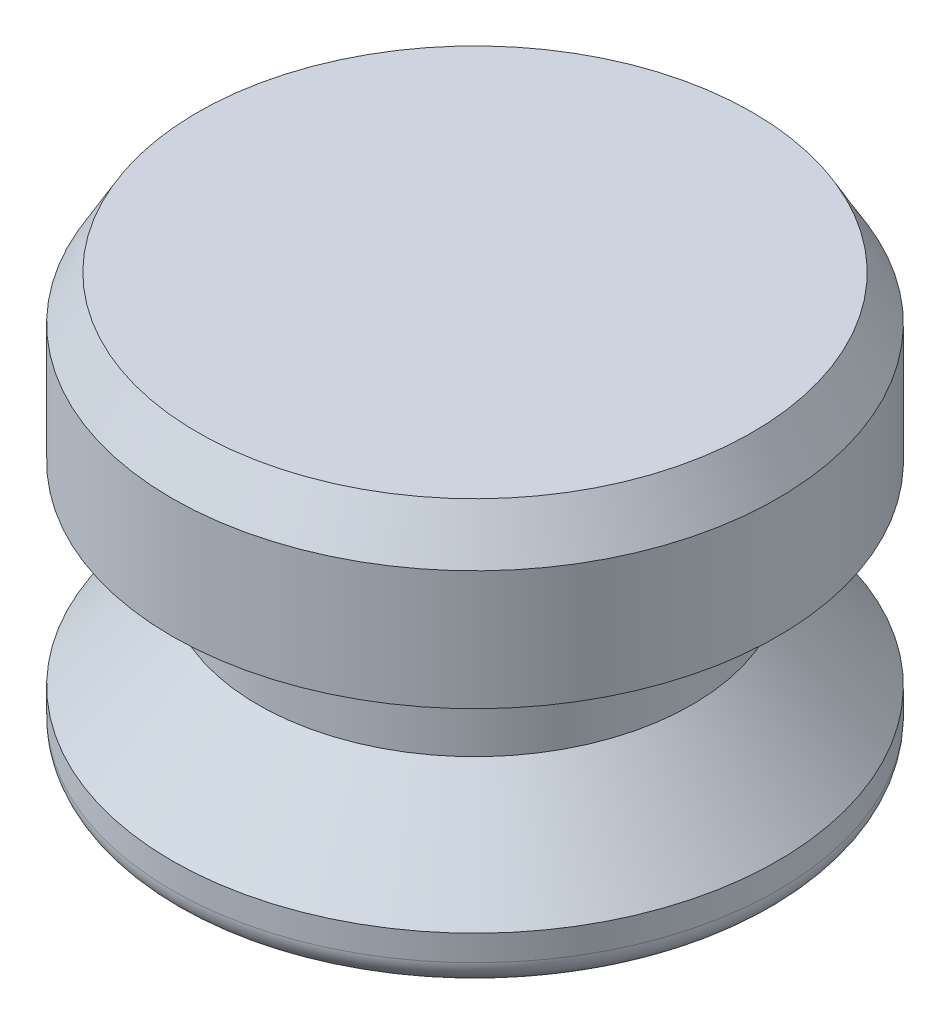
ISO-10303-21;
HEADER;
FILE_DESCRIPTION(('STEP AP214'),'2;1');
FILE_NAME('part.step','',(''),(''),'','','');
FILE_SCHEMA(('AUTOMOTIVE_DESIGN { 1 0 10303 214 1 1 1 1 }'));
ENDSEC;
DATA;
#1=APPLICATION_CONTEXT('core data for automotive mechanical design processes');
#2=APPLICATION_PROTOCOL_DEFINITION('international standard','automotive_design',2000,#1);
#3=PRODUCT_CONTEXT('',#1,'mechanical');
#4=PRODUCT('Part','Part','',(#3));
#5=PRODUCT_RELATED_PRODUCT_CATEGORY('part','',(#4));
#6=PRODUCT_DEFINITION_FORMATION('','',#4);
#7=PRODUCT_DEFINITION_CONTEXT('part definition',#1,'design');
#8=PRODUCT_DEFINITION('design','',#6,#7);
#9=PRODUCT_DEFINITION_SHAPE('','',#8);
#10=(LENGTH_UNIT() NAMED_UNIT(*) SI_UNIT(.MILLI.,.METRE.));
#11=(NAMED_UNIT(*) PLANE_ANGLE_UNIT() SI_UNIT($,.RADIAN.));
#12=(NAMED_UNIT(*) SI_UNIT($,.STERADIAN.) SOLID_ANGLE_UNIT());
#13=UNCERTAINTY_MEASURE_WITH_UNIT(LENGTH_MEASURE(1.E-05),#10,'distance_accuracy_value','');
#14=(GEOMETRIC_REPRESENTATION_CONTEXT(3) GLOBAL_UNCERTAINTY_ASSIGNED_CONTEXT((#13)) GLOBAL_UNIT_ASSIGNED_CONTEXT((#10,
#11,#12)) REPRESENTATION_CONTEXT('',''));
#15=CARTESIAN_POINT('',(0.,0.,0.));
#16=DIRECTION('',(0.,0.,1.));
#17=DIRECTION('',(1.,0.,0.));
#18=AXIS2_PLACEMENT_3D('',#15,#16,#17);
#19=CARTESIAN_POINT('',(0.,0.,0.));
#20=DIRECTION('',(0.,1.,0.));
#21=DIRECTION('',(0.,0.,1.));
#22=AXIS2_PLACEMENT_3D('',#19,#20,#21);
#23=PLANE('',#22);
#24=CARTESIAN_POINT('',(0.,0.,0.));
#25=DIRECTION('',(0.,1.,0.));
#26=DIRECTION('',(0.,0.,1.));
#27=AXIS2_PLACEMENT_3D('',#24,#25,#26);
#28=CIRCLE('',#27,8.60425);
#29=CARTESIAN_POINT('',(0.,0.,8.60425));
#30=VERTEX_POINT('',#29);
#31=EDGE_CURVE('E46',#30,#30,#28,.F.);
#32=ORIENTED_EDGE('',*,*,#31,.T.);
#33=EDGE_LOOP('',(#32));
#34=FACE_BOUND('',#33,.T.);
#35=ADVANCED_FACE('F31',(#34),#23,.F.);
#36=CARTESIAN_POINT('',(0.,0.,0.));
#37=DIRECTION('',(0.,-1.,0.));
#38=DIRECTION('',(0.,0.,-1.));
#39=AXIS2_PLACEMENT_3D('',#36,#37,#38);
#40=CYLINDRICAL_SURFACE('',#39,9.398);
#41=CARTESIAN_POINT('',(0.,0.793749999999999,0.));
#42=DIRECTION('',(0.,1.,0.));
#43=DIRECTION('',(0.,0.,1.));
#44=AXIS2_PLACEMENT_3D('',#41,#42,#43);
#45=CIRCLE('',#44,9.398);
#46=CARTESIAN_POINT('',(0.,0.793749999999999,9.398));
#47=VERTEX_POINT('',#46);
#48=EDGE_CURVE('E42',#47,#47,#45,.T.);
#49=ORIENTED_EDGE('',*,*,#48,.T.);
#50=EDGE_LOOP('',(#49));
#51=FACE_BOUND('',#50,.T.);
#52=CARTESIAN_POINT('',(0.,1.5875,0.));
#53=DIRECTION('',(0.,-1.,0.));
#54=DIRECTION('',(0.,0.,-1.));
#55=AXIS2_PLACEMENT_3D('',#52,#53,#54);
#56=CIRCLE('',#55,9.398);
#57=CARTESIAN_POINT('',(0.,1.5875,-9.398));
#58=VERTEX_POINT('',#57);
#59=EDGE_CURVE('E51',#58,#58,#56,.T.);
#60=ORIENTED_EDGE('',*,*,#59,.T.);
#61=EDGE_LOOP('',(#60));
#62=FACE_BOUND('',#61,.T.);
#63=ADVANCED_FACE('F80',(#51,#62),#40,.T.);
#64=CARTESIAN_POINT('',(0.,4.445,0.));
#65=DIRECTION('',(0.,-1.,0.));
#66=DIRECTION('',(0.,0.,-1.));
#67=AXIS2_PLACEMENT_3D('',#64,#65,#66);
#68=CONICAL_SURFACE('',#67,6.731,0.75092906239794);
#69=ORIENTED_EDGE('',*,*,#59,.F.);
#70=EDGE_LOOP('',(#69));
#71=FACE_BOUND('',#70,.T.);
#72=CARTESIAN_POINT('',(0.,4.445,0.));
#73=DIRECTION('',(0.,-1.,0.));
#74=DIRECTION('',(0.,0.,-1.));
#75=AXIS2_PLACEMENT_3D('',#72,#73,#74);
#76=CIRCLE('',#75,6.731);
#77=CARTESIAN_POINT('',(0.,4.445,-6.731));
#78=VERTEX_POINT('',#77);
#79=EDGE_CURVE('E54',#78,#78,#76,.T.);
#80=ORIENTED_EDGE('',*,*,#79,.T.);
#81=EDGE_LOOP('',(#80));
#82=FACE_BOUND('',#81,.T.);
#83=ADVANCED_FACE('F86',(#71,#82),#68,.T.);
#84=CARTESIAN_POINT('',(0.,0.,0.));
#85=DIRECTION('',(0.,-1.,0.));
#86=DIRECTION('',(0.,0.,-1.));
#87=AXIS2_PLACEMENT_3D('',#84,#85,#86);
#88=CYLINDRICAL_SURFACE('',#87,6.731);
#89=ORIENTED_EDGE('',*,*,#79,.F.);
#90=EDGE_LOOP('',(#89));
#91=FACE_BOUND('',#90,.T.);
#92=CARTESIAN_POINT('',(0.,7.62,0.));
#93=DIRECTION('',(0.,-1.,0.));
#94=DIRECTION('',(0.,0.,-1.));
#95=AXIS2_PLACEMENT_3D('',#92,#93,#94);
#96=CIRCLE('',#95,6.731);
#97=CARTESIAN_POINT('',(0.,7.62,-6.731));
#98=VERTEX_POINT('',#97);
#99=EDGE_CURVE('E57',#98,#98,#96,.T.);
#100=ORIENTED_EDGE('',*,*,#99,.T.);
#101=EDGE_LOOP('',(#100));
#102=FACE_BOUND('',#101,.T.);
#103=ADVANCED_FACE('F76',(#91,#102),#88,.T.);
#104=CARTESIAN_POINT('',(-6.731,7.62,0.));
#105=DIRECTION('',(0.,1.,0.));
#106=DIRECTION('',(0.,0.,1.));
#107=AXIS2_PLACEMENT_3D('',#104,#105,#106);
#108=PLANE('',#107);
#109=ORIENTED_EDGE('',*,*,#99,.F.);
#110=EDGE_LOOP('',(#109));
#111=FACE_BOUND('',#110,.T.);
#112=CARTESIAN_POINT('',(0.,7.62,0.));
#113=DIRECTION('',(0.,-1.,0.));
#114=DIRECTION('',(0.,0.,-1.));
#115=AXIS2_PLACEMENT_3D('',#112,#113,#114);
#116=CIRCLE('',#115,9.398);
#117=CARTESIAN_POINT('',(0.,7.62,-9.398));
#118=VERTEX_POINT('',#117);
#119=EDGE_CURVE('E60',#118,#118,#116,.T.);
#120=ORIENTED_EDGE('',*,*,#119,.T.);
#121=EDGE_LOOP('',(#120));
#122=FACE_BOUND('',#121,.T.);
#123=ADVANCED_FACE('F64',(#111,#122),#108,.F.);
#124=CARTESIAN_POINT('',(0.,0.,0.));
#125=DIRECTION('',(0.,-1.,0.));
#126=DIRECTION('',(0.,0.,-1.));
#127=AXIS2_PLACEMENT_3D('',#124,#125,#126);
#128=CYLINDRICAL_SURFACE('',#127,9.398);
#129=CARTESIAN_POINT('',(0.,11.3251846714922,0.));
#130=DIRECTION('',(0.,-1.,0.));
#131=DIRECTION('',(0.,0.,-1.));
#132=AXIS2_PLACEMENT_3D('',#129,#130,#131);
#133=CIRCLE('',#132,9.398);
#134=CARTESIAN_POINT('',(0.,11.3251846714922,-9.398));
#135=VERTEX_POINT('',#134);
#136=EDGE_CURVE('E38',#135,#135,#133,.T.);
#137=ORIENTED_EDGE('',*,*,#136,.T.);
#138=EDGE_LOOP('',(#137));
#139=FACE_BOUND('',#138,.T.);
#140=ORIENTED_EDGE('',*,*,#119,.F.);
#141=EDGE_LOOP('',(#140));
#142=FACE_BOUND('',#141,.T.);
#143=ADVANCED_FACE('F66',(#139,#142),#128,.T.);
#144=CARTESIAN_POINT('',(-9.398,12.7,0.));
#145=DIRECTION('',(0.,-1.,0.));
#146=DIRECTION('',(0.,0.,-1.));
#147=AXIS2_PLACEMENT_3D('',#144,#145,#146);
#148=PLANE('',#147);
#149=CARTESIAN_POINT('',(0.,12.7,0.));
#150=DIRECTION('',(0.,-1.,0.));
#151=DIRECTION('',(0.,0.,-1.));
#152=AXIS2_PLACEMENT_3D('',#149,#150,#151);
#153=CIRCLE('',#152,8.60424999999999);
#154=CARTESIAN_POINT('',(0.,12.7,-8.60424999999999));
#155=VERTEX_POINT('',#154);
#156=EDGE_CURVE('E10',#155,#155,#153,.F.);
#157=ORIENTED_EDGE('',*,*,#156,.T.);
#158=EDGE_LOOP('',(#157));
#159=FACE_BOUND('',#158,.T.);
#160=ADVANCED_FACE('F68',(#159),#148,.F.);
#161=CARTESIAN_POINT('',(0.,0.793749999999999,0.));
#162=DIRECTION('',(0.,1.,0.));
#163=DIRECTION('',(0.,0.,1.));
#164=AXIS2_PLACEMENT_3D('',#161,#162,#163);
#165=TOROIDAL_SURFACE('',#164,8.60425,0.79375);
#166=ORIENTED_EDGE('',*,*,#48,.F.);
#167=EDGE_LOOP('',(#166));
#168=FACE_BOUND('',#167,.T.);
#169=ORIENTED_EDGE('',*,*,#31,.F.);
#170=EDGE_LOOP('',(#169));
#171=FACE_BOUND('',#170,.T.);
#172=ADVANCED_FACE('F74',(#168,#171),#165,.T.);
#173=CARTESIAN_POINT('',(0.,11.3251846714922,0.));
#174=DIRECTION('',(0.,-1.,0.));
#175=DIRECTION('',(0.,0.,-1.));
#176=AXIS2_PLACEMENT_3D('',#173,#174,#175);
#177=CONICAL_SURFACE('',#176,9.398,0.5235987755983);
#178=ORIENTED_EDGE('',*,*,#156,.F.);
#179=EDGE_LOOP('',(#178));
#180=FACE_BOUND('',#179,.T.);
#181=ORIENTED_EDGE('',*,*,#136,.F.);
#182=EDGE_LOOP('',(#181));
#183=FACE_BOUND('',#182,.T.);
#184=ADVANCED_FACE('F33',(#180,#183),#177,.T.);
#185=CLOSED_SHELL('',(#35,#63,#83,#103,#123,#143,#160,#172,#184));
#186=MANIFOLD_SOLID_BREP('B2',#185);
#187=ADVANCED_BREP_SHAPE_REPRESENTATION('',(#18,#186),#14);
#188=SHAPE_DEFINITION_REPRESENTATION(#9,#187);
ENDSEC;
END-ISO-10303-21;
